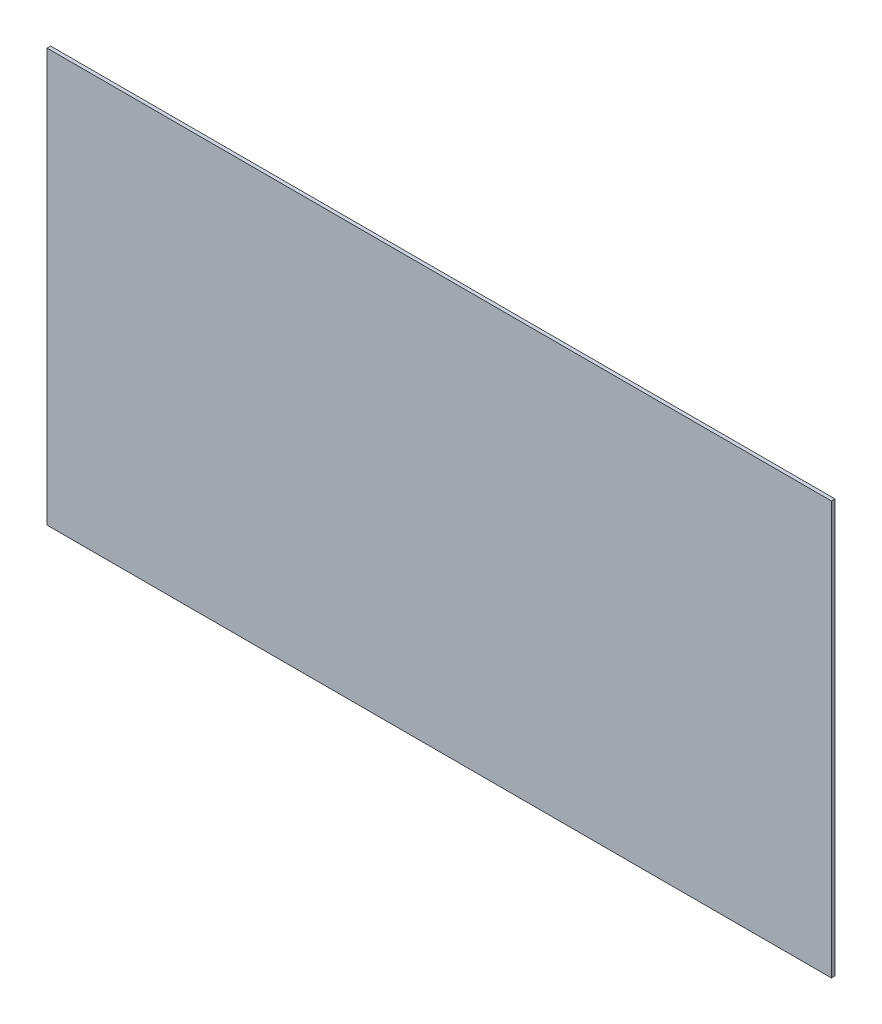
ISO-10303-21;
HEADER;
FILE_DESCRIPTION(('STEP AP214'),'2;1');
FILE_NAME('part.step','',(''),(''),'','','');
FILE_SCHEMA(('AUTOMOTIVE_DESIGN { 1 0 10303 214 1 1 1 1 }'));
ENDSEC;
DATA;
#1=APPLICATION_CONTEXT('core data for automotive mechanical design processes');
#2=APPLICATION_PROTOCOL_DEFINITION('international standard','automotive_design',2000,#1);
#3=PRODUCT_CONTEXT('',#1,'mechanical');
#4=PRODUCT('Part','Part','',(#3));
#5=PRODUCT_RELATED_PRODUCT_CATEGORY('part','',(#4));
#6=PRODUCT_DEFINITION_FORMATION('','',#4);
#7=PRODUCT_DEFINITION_CONTEXT('part definition',#1,'design');
#8=PRODUCT_DEFINITION('design','',#6,#7);
#9=PRODUCT_DEFINITION_SHAPE('','',#8);
#10=(LENGTH_UNIT() NAMED_UNIT(*) SI_UNIT(.MILLI.,.METRE.));
#11=(NAMED_UNIT(*) PLANE_ANGLE_UNIT() SI_UNIT($,.RADIAN.));
#12=(NAMED_UNIT(*) SI_UNIT($,.STERADIAN.) SOLID_ANGLE_UNIT());
#13=UNCERTAINTY_MEASURE_WITH_UNIT(LENGTH_MEASURE(1.E-05),#10,'distance_accuracy_value','');
#14=(GEOMETRIC_REPRESENTATION_CONTEXT(3) GLOBAL_UNCERTAINTY_ASSIGNED_CONTEXT((#13)) GLOBAL_UNIT_ASSIGNED_CONTEXT((#10,
#11,#12)) REPRESENTATION_CONTEXT('',''));
#15=CARTESIAN_POINT('',(0.,0.,0.));
#16=DIRECTION('',(0.,0.,1.));
#17=DIRECTION('',(1.,0.,0.));
#18=AXIS2_PLACEMENT_3D('',#15,#16,#17);
#19=CARTESIAN_POINT('',(-165.1,788.53,0.75));
#20=DIRECTION('',(1.,0.,0.));
#21=DIRECTION('',(0.,0.,-1.));
#22=AXIS2_PLACEMENT_3D('',#19,#20,#21);
#23=PLANE('',#22);
#24=DIRECTION('',(0.,-1.,0.));
#25=VECTOR('',#24,1.);
#26=CARTESIAN_POINT('',(-165.1,788.53,-0.75));
#27=LINE('',#26,#25);
#28=CARTESIAN_POINT('',(-165.1,962.43,-0.75));
#29=VERTEX_POINT('',#28);
#30=CARTESIAN_POINT('',(-165.1,788.53,-0.75));
#31=VERTEX_POINT('',#30);
#32=EDGE_CURVE('E113',#29,#31,#27,.T.);
#33=ORIENTED_EDGE('',*,*,#32,.T.);
#34=DIRECTION('',(0.,0.,-1.));
#35=VECTOR('',#34,1.);
#36=CARTESIAN_POINT('',(-165.1,788.53,0.75));
#37=LINE('',#36,#35);
#38=CARTESIAN_POINT('',(-165.1,788.53,0.75));
#39=VERTEX_POINT('',#38);
#40=EDGE_CURVE('E11',#39,#31,#37,.T.);
#41=ORIENTED_EDGE('',*,*,#40,.F.);
#42=DIRECTION('',(0.,-1.,0.));
#43=VECTOR('',#42,1.);
#44=CARTESIAN_POINT('',(-165.1,788.53,0.75));
#45=LINE('',#44,#43);
#46=CARTESIAN_POINT('',(-165.1,962.43,0.75));
#47=VERTEX_POINT('',#46);
#48=EDGE_CURVE('E96',#47,#39,#45,.T.);
#49=ORIENTED_EDGE('',*,*,#48,.F.);
#50=DIRECTION('',(0.,0.,-1.));
#51=VECTOR('',#50,1.);
#52=CARTESIAN_POINT('',(-165.1,962.43,0.75));
#53=LINE('',#52,#51);
#54=EDGE_CURVE('E109',#47,#29,#53,.T.);
#55=ORIENTED_EDGE('',*,*,#54,.T.);
#56=EDGE_LOOP('',(#33,#41,#49,#55));
#57=FACE_BOUND('',#56,.T.);
#58=ADVANCED_FACE('F38',(#57),#23,.F.);
#59=CARTESIAN_POINT('',(-165.1,788.53,0.75));
#60=DIRECTION('',(0.,1.,0.));
#61=DIRECTION('',(0.,0.,1.));
#62=AXIS2_PLACEMENT_3D('',#59,#60,#61);
#63=PLANE('',#62);
#64=DIRECTION('',(1.,0.,0.));
#65=VECTOR('',#64,1.);
#66=CARTESIAN_POINT('',(-165.1,788.53,-0.75));
#67=LINE('',#66,#65);
#68=CARTESIAN_POINT('',(165.1,788.53,-0.75));
#69=VERTEX_POINT('',#68);
#70=EDGE_CURVE('E101',#31,#69,#67,.T.);
#71=ORIENTED_EDGE('',*,*,#70,.T.);
#72=DIRECTION('',(0.,0.,-1.));
#73=VECTOR('',#72,1.);
#74=CARTESIAN_POINT('',(165.1,788.53,0.75));
#75=LINE('',#74,#73);
#76=CARTESIAN_POINT('',(165.1,788.53,0.75));
#77=VERTEX_POINT('',#76);
#78=EDGE_CURVE('E47',#77,#69,#75,.T.);
#79=ORIENTED_EDGE('',*,*,#78,.F.);
#80=DIRECTION('',(1.,0.,0.));
#81=VECTOR('',#80,1.);
#82=CARTESIAN_POINT('',(-165.1,788.53,0.75));
#83=LINE('',#82,#81);
#84=EDGE_CURVE('E90',#39,#77,#83,.T.);
#85=ORIENTED_EDGE('',*,*,#84,.F.);
#86=ORIENTED_EDGE('',*,*,#40,.T.);
#87=EDGE_LOOP('',(#71,#79,#85,#86));
#88=FACE_BOUND('',#87,.T.);
#89=ADVANCED_FACE('F100',(#88),#63,.F.);
#90=CARTESIAN_POINT('',(165.1,788.53,0.75));
#91=DIRECTION('',(-1.,0.,0.));
#92=DIRECTION('',(0.,0.,1.));
#93=AXIS2_PLACEMENT_3D('',#90,#91,#92);
#94=PLANE('',#93);
#95=DIRECTION('',(0.,1.,0.));
#96=VECTOR('',#95,1.);
#97=CARTESIAN_POINT('',(165.1,788.53,-0.75));
#98=LINE('',#97,#96);
#99=CARTESIAN_POINT('',(165.1,962.43,-0.75));
#100=VERTEX_POINT('',#99);
#101=EDGE_CURVE('E76',#69,#100,#98,.T.);
#102=ORIENTED_EDGE('',*,*,#101,.T.);
#103=DIRECTION('',(0.,0.,-1.));
#104=VECTOR('',#103,1.);
#105=CARTESIAN_POINT('',(165.1,962.43,0.75));
#106=LINE('',#105,#104);
#107=CARTESIAN_POINT('',(165.1,962.43,0.75));
#108=VERTEX_POINT('',#107);
#109=EDGE_CURVE('E103',#108,#100,#106,.T.);
#110=ORIENTED_EDGE('',*,*,#109,.F.);
#111=DIRECTION('',(0.,1.,0.));
#112=VECTOR('',#111,1.);
#113=CARTESIAN_POINT('',(165.1,788.53,0.75));
#114=LINE('',#113,#112);
#115=EDGE_CURVE('E94',#77,#108,#114,.T.);
#116=ORIENTED_EDGE('',*,*,#115,.F.);
#117=ORIENTED_EDGE('',*,*,#78,.T.);
#118=EDGE_LOOP('',(#102,#110,#116,#117));
#119=FACE_BOUND('',#118,.T.);
#120=ADVANCED_FACE('F104',(#119),#94,.F.);
#121=CARTESIAN_POINT('',(-165.1,962.43,0.75));
#122=DIRECTION('',(0.,-1.,0.));
#123=DIRECTION('',(0.,0.,-1.));
#124=AXIS2_PLACEMENT_3D('',#121,#122,#123);
#125=PLANE('',#124);
#126=DIRECTION('',(-1.,0.,0.));
#127=VECTOR('',#126,1.);
#128=CARTESIAN_POINT('',(-165.1,962.43,-0.75));
#129=LINE('',#128,#127);
#130=EDGE_CURVE('E82',#100,#29,#129,.T.);
#131=ORIENTED_EDGE('',*,*,#130,.T.);
#132=ORIENTED_EDGE('',*,*,#54,.F.);
#133=DIRECTION('',(-1.,0.,0.));
#134=VECTOR('',#133,1.);
#135=CARTESIAN_POINT('',(-165.1,962.43,0.75));
#136=LINE('',#135,#134);
#137=EDGE_CURVE('E58',#108,#47,#136,.T.);
#138=ORIENTED_EDGE('',*,*,#137,.F.);
#139=ORIENTED_EDGE('',*,*,#109,.T.);
#140=EDGE_LOOP('',(#131,#132,#138,#139));
#141=FACE_BOUND('',#140,.T.);
#142=ADVANCED_FACE('F124',(#141),#125,.F.);
#143=CARTESIAN_POINT('',(-165.1,962.43,0.75));
#144=DIRECTION('',(0.,0.,-1.));
#145=DIRECTION('',(-1.,0.,0.));
#146=AXIS2_PLACEMENT_3D('',#143,#144,#145);
#147=PLANE('',#146);
#148=ORIENTED_EDGE('',*,*,#48,.T.);
#149=ORIENTED_EDGE('',*,*,#84,.T.);
#150=ORIENTED_EDGE('',*,*,#115,.T.);
#151=ORIENTED_EDGE('',*,*,#137,.T.);
#152=EDGE_LOOP('',(#148,#149,#150,#151));
#153=FACE_BOUND('',#152,.T.);
#154=ADVANCED_FACE('F92',(#153),#147,.F.);
#155=CARTESIAN_POINT('',(-165.1,962.43,-0.75));
#156=DIRECTION('',(0.,0.,-1.));
#157=DIRECTION('',(-1.,0.,0.));
#158=AXIS2_PLACEMENT_3D('',#155,#156,#157);
#159=PLANE('',#158);
#160=ORIENTED_EDGE('',*,*,#32,.F.);
#161=ORIENTED_EDGE('',*,*,#130,.F.);
#162=ORIENTED_EDGE('',*,*,#101,.F.);
#163=ORIENTED_EDGE('',*,*,#70,.F.);
#164=EDGE_LOOP('',(#160,#161,#162,#163));
#165=FACE_BOUND('',#164,.T.);
#166=ADVANCED_FACE('F127',(#165),#159,.T.);
#167=CLOSED_SHELL('',(#58,#89,#120,#142,#154,#166));
#168=MANIFOLD_SOLID_BREP('B2',#167);
#169=ADVANCED_BREP_SHAPE_REPRESENTATION('',(#18,#168),#14);
#170=SHAPE_DEFINITION_REPRESENTATION(#9,#169);
ENDSEC;
END-ISO-10303-21;
